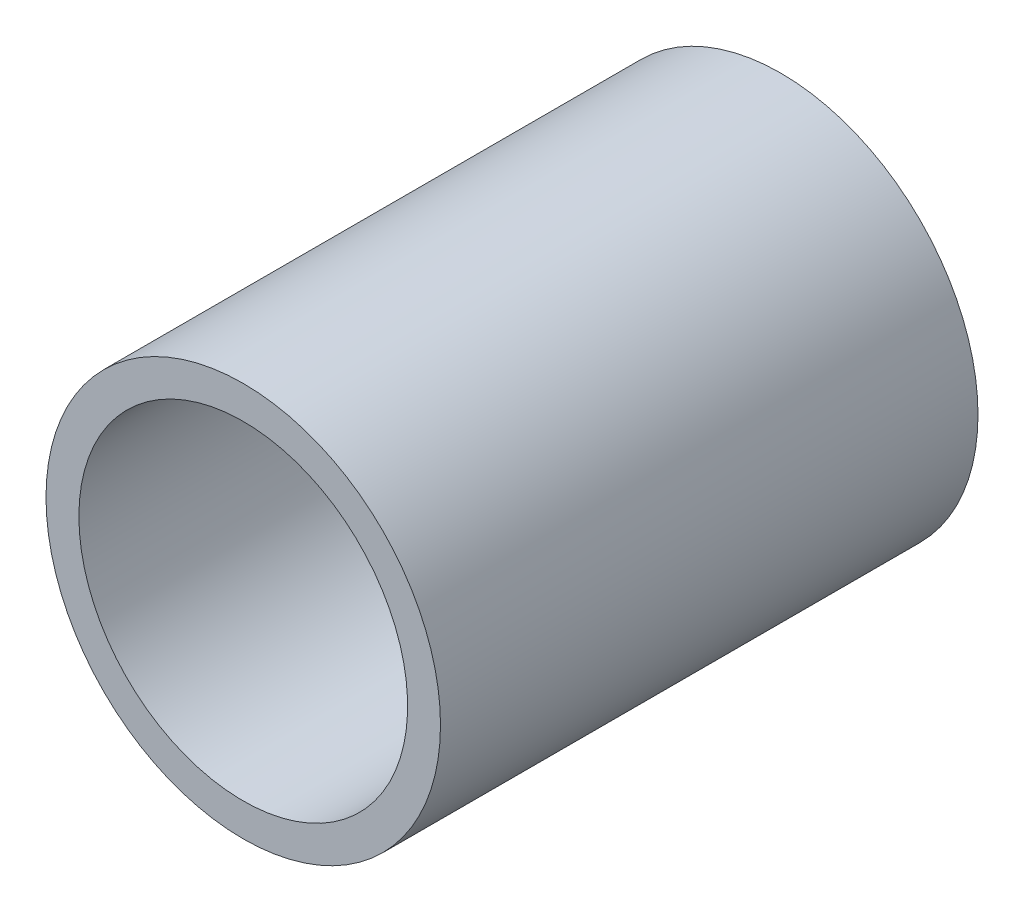
ISO-10303-21;
HEADER;
FILE_DESCRIPTION(('STEP AP214'),'2;1');
FILE_NAME('part.step','',(''),(''),'','','');
FILE_SCHEMA(('AUTOMOTIVE_DESIGN { 1 0 10303 214 1 1 1 1 }'));
ENDSEC;
DATA;
#1=APPLICATION_CONTEXT('core data for automotive mechanical design processes');
#2=APPLICATION_PROTOCOL_DEFINITION('international standard','automotive_design',2000,#1);
#3=PRODUCT_CONTEXT('',#1,'mechanical');
#4=PRODUCT('Part','Part','',(#3));
#5=PRODUCT_RELATED_PRODUCT_CATEGORY('part','',(#4));
#6=PRODUCT_DEFINITION_FORMATION('','',#4);
#7=PRODUCT_DEFINITION_CONTEXT('part definition',#1,'design');
#8=PRODUCT_DEFINITION('design','',#6,#7);
#9=PRODUCT_DEFINITION_SHAPE('','',#8);
#10=(LENGTH_UNIT() NAMED_UNIT(*) SI_UNIT(.MILLI.,.METRE.));
#11=(NAMED_UNIT(*) PLANE_ANGLE_UNIT() SI_UNIT($,.RADIAN.));
#12=(NAMED_UNIT(*) SI_UNIT($,.STERADIAN.) SOLID_ANGLE_UNIT());
#13=UNCERTAINTY_MEASURE_WITH_UNIT(LENGTH_MEASURE(1.E-05),#10,'distance_accuracy_value','');
#14=(GEOMETRIC_REPRESENTATION_CONTEXT(3) GLOBAL_UNCERTAINTY_ASSIGNED_CONTEXT((#13)) GLOBAL_UNIT_ASSIGNED_CONTEXT((#10,
#11,#12)) REPRESENTATION_CONTEXT('',''));
#15=CARTESIAN_POINT('',(0.,0.,0.));
#16=DIRECTION('',(0.,0.,1.));
#17=DIRECTION('',(1.,0.,0.));
#18=AXIS2_PLACEMENT_3D('',#15,#16,#17);
#19=CARTESIAN_POINT('',(0.,0.,0.));
#20=DIRECTION('',(0.,0.,1.));
#21=DIRECTION('',(1.,0.,0.));
#22=AXIS2_PLACEMENT_3D('',#19,#20,#21);
#23=PLANE('',#22);
#24=CARTESIAN_POINT('',(0.,0.,0.));
#25=DIRECTION('',(0.,0.,1.));
#26=DIRECTION('',(1.,0.,0.));
#27=AXIS2_PLACEMENT_3D('',#24,#25,#26);
#28=CIRCLE('',#27,6.);
#29=CARTESIAN_POINT('',(6.,0.,0.));
#30=VERTEX_POINT('',#29);
#31=EDGE_CURVE('E44',#30,#30,#28,.T.);
#32=ORIENTED_EDGE('',*,*,#31,.F.);
#33=EDGE_LOOP('',(#32));
#34=FACE_BOUND('',#33,.T.);
#35=CARTESIAN_POINT('',(0.,0.,0.));
#36=DIRECTION('',(0.,0.,1.));
#37=DIRECTION('',(1.,0.,0.));
#38=AXIS2_PLACEMENT_3D('',#35,#36,#37);
#39=CIRCLE('',#38,5.);
#40=CARTESIAN_POINT('',(5.,0.,0.));
#41=VERTEX_POINT('',#40);
#42=EDGE_CURVE('E53',#41,#41,#39,.T.);
#43=ORIENTED_EDGE('',*,*,#42,.T.);
#44=EDGE_LOOP('',(#43));
#45=FACE_BOUND('',#44,.T.);
#46=ADVANCED_FACE('F37',(#34,#45),#23,.F.);
#47=CARTESIAN_POINT('',(0.,0.,33.3205627484772));
#48=DIRECTION('',(0.,0.,-1.));
#49=DIRECTION('',(-1.,0.,0.));
#50=AXIS2_PLACEMENT_3D('',#47,#48,#49);
#51=CYLINDRICAL_SURFACE('',#50,6.);
#52=CARTESIAN_POINT('',(0.,0.,16.35));
#53=DIRECTION('',(0.,0.,-1.));
#54=DIRECTION('',(-1.,0.,0.));
#55=AXIS2_PLACEMENT_3D('',#52,#53,#54);
#56=CIRCLE('',#55,6.);
#57=CARTESIAN_POINT('',(-6.,0.,16.35));
#58=VERTEX_POINT('',#57);
#59=EDGE_CURVE('E48',#58,#58,#56,.T.);
#60=ORIENTED_EDGE('',*,*,#59,.T.);
#61=EDGE_LOOP('',(#60));
#62=FACE_BOUND('',#61,.T.);
#63=ORIENTED_EDGE('',*,*,#31,.T.);
#64=EDGE_LOOP('',(#63));
#65=FACE_BOUND('',#64,.T.);
#66=ADVANCED_FACE('F61',(#62,#65),#51,.T.);
#67=CARTESIAN_POINT('',(0.,0.,33.3205627484772));
#68=DIRECTION('',(0.,0.,-1.));
#69=DIRECTION('',(-1.,0.,0.));
#70=AXIS2_PLACEMENT_3D('',#67,#68,#69);
#71=CYLINDRICAL_SURFACE('',#70,5.);
#72=CARTESIAN_POINT('',(0.,0.,16.35));
#73=DIRECTION('',(0.,0.,-1.));
#74=DIRECTION('',(-1.,0.,0.));
#75=AXIS2_PLACEMENT_3D('',#72,#73,#74);
#76=CIRCLE('',#75,5.);
#77=CARTESIAN_POINT('',(-5.,0.,16.35));
#78=VERTEX_POINT('',#77);
#79=EDGE_CURVE('E10',#78,#78,#76,.T.);
#80=ORIENTED_EDGE('',*,*,#79,.F.);
#81=EDGE_LOOP('',(#80));
#82=FACE_BOUND('',#81,.T.);
#83=ORIENTED_EDGE('',*,*,#42,.F.);
#84=EDGE_LOOP('',(#83));
#85=FACE_BOUND('',#84,.T.);
#86=ADVANCED_FACE('F59',(#82,#85),#71,.F.);
#87=CARTESIAN_POINT('',(69.5793538923496,36.2624256210637,16.35));
#88=DIRECTION('',(0.,0.,-1.));
#89=DIRECTION('',(0.831506028154189,0.555515728979158,0.));
#90=AXIS2_PLACEMENT_3D('',#87,#88,#89);
#91=PLANE('',#90);
#92=ORIENTED_EDGE('',*,*,#79,.T.);
#93=EDGE_LOOP('',(#92));
#94=FACE_BOUND('',#93,.T.);
#95=ORIENTED_EDGE('',*,*,#59,.F.);
#96=EDGE_LOOP('',(#95));
#97=FACE_BOUND('',#96,.T.);
#98=ADVANCED_FACE('F39',(#94,#97),#91,.F.);
#99=CLOSED_SHELL('',(#46,#66,#86,#98));
#100=MANIFOLD_SOLID_BREP('B2',#99);
#101=ADVANCED_BREP_SHAPE_REPRESENTATION('',(#18,#100),#14);
#102=SHAPE_DEFINITION_REPRESENTATION(#9,#101);
ENDSEC;
END-ISO-10303-21;
